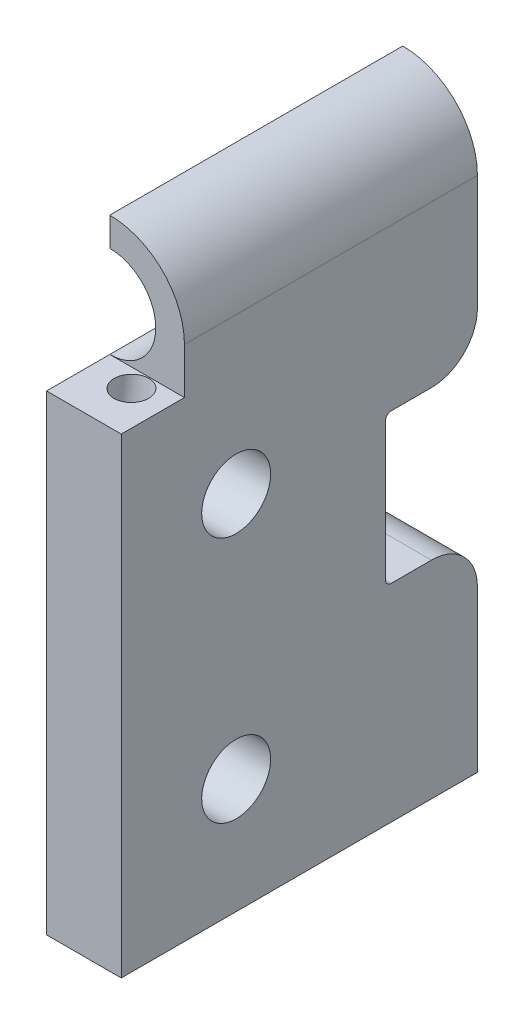
ISO-10303-21;
HEADER;
FILE_DESCRIPTION(('STEP AP214'),'2;1');
FILE_NAME('part.step','',(''),(''),'','','');
FILE_SCHEMA(('AUTOMOTIVE_DESIGN { 1 0 10303 214 1 1 1 1 }'));
ENDSEC;
DATA;
#1=APPLICATION_CONTEXT('core data for automotive mechanical design processes');
#2=APPLICATION_PROTOCOL_DEFINITION('international standard','automotive_design',2000,#1);
#3=PRODUCT_CONTEXT('',#1,'mechanical');
#4=PRODUCT('Part','Part','',(#3));
#5=PRODUCT_RELATED_PRODUCT_CATEGORY('part','',(#4));
#6=PRODUCT_DEFINITION_FORMATION('','',#4);
#7=PRODUCT_DEFINITION_CONTEXT('part definition',#1,'design');
#8=PRODUCT_DEFINITION('design','',#6,#7);
#9=PRODUCT_DEFINITION_SHAPE('','',#8);
#10=(LENGTH_UNIT() NAMED_UNIT(*) SI_UNIT(.MILLI.,.METRE.));
#11=(NAMED_UNIT(*) PLANE_ANGLE_UNIT() SI_UNIT($,.RADIAN.));
#12=(NAMED_UNIT(*) SI_UNIT($,.STERADIAN.) SOLID_ANGLE_UNIT());
#13=UNCERTAINTY_MEASURE_WITH_UNIT(LENGTH_MEASURE(1.E-05),#10,'distance_accuracy_value','');
#14=(GEOMETRIC_REPRESENTATION_CONTEXT(3) GLOBAL_UNCERTAINTY_ASSIGNED_CONTEXT((#13)) GLOBAL_UNIT_ASSIGNED_CONTEXT((#10,
#11,#12)) REPRESENTATION_CONTEXT('',''));
#15=CARTESIAN_POINT('',(0.,0.,0.));
#16=DIRECTION('',(0.,0.,1.));
#17=DIRECTION('',(1.,0.,0.));
#18=AXIS2_PLACEMENT_3D('',#15,#16,#17);
#19=CARTESIAN_POINT('',(-3.75,22.5,31.));
#20=DIRECTION('',(1.,0.,0.));
#21=DIRECTION('',(0.,1.,0.));
#22=AXIS2_PLACEMENT_3D('',#19,#20,#21);
#23=PLANE('',#22);
#24=DIRECTION('',(0.,-1.,0.));
#25=VECTOR('',#24,1.);
#26=CARTESIAN_POINT('',(-3.75,22.5,0.));
#27=LINE('',#26,#25);
#28=CARTESIAN_POINT('',(-3.75,29.,0.));
#29=VERTEX_POINT('',#28);
#30=CARTESIAN_POINT('',(-3.75,26.5,0.));
#31=VERTEX_POINT('',#30);
#32=EDGE_CURVE('E174',#29,#31,#27,.T.);
#33=ORIENTED_EDGE('',*,*,#32,.T.);
#34=DIRECTION('',(0.,0.,1.));
#35=VECTOR('',#34,1.);
#36=CARTESIAN_POINT('',(-3.75,26.5,-0.001000000000001));
#37=LINE('',#36,#35);
#38=CARTESIAN_POINT('',(-3.75,26.5,25.5));
#39=VERTEX_POINT('',#38);
#40=EDGE_CURVE('E155',#31,#39,#37,.T.);
#41=ORIENTED_EDGE('',*,*,#40,.T.);
#42=DIRECTION('',(0.,-1.,0.));
#43=VECTOR('',#42,1.);
#44=CARTESIAN_POINT('',(-3.75,29.,25.5));
#45=LINE('',#44,#43);
#46=CARTESIAN_POINT('',(-3.75,29.,25.5));
#47=VERTEX_POINT('',#46);
#48=EDGE_CURVE('E233',#47,#39,#45,.T.);
#49=ORIENTED_EDGE('',*,*,#48,.F.);
#50=DIRECTION('',(0.,0.,-1.));
#51=VECTOR('',#50,1.);
#52=CARTESIAN_POINT('',(-3.75,29.,31.));
#53=LINE('',#52,#51);
#54=EDGE_CURVE('E181',#47,#29,#53,.T.);
#55=ORIENTED_EDGE('',*,*,#54,.T.);
#56=EDGE_LOOP('',(#33,#41,#49,#55));
#57=FACE_BOUND('',#56,.T.);
#58=ADVANCED_FACE('F45',(#57),#23,.F.);
#59=CARTESIAN_POINT('',(-3.75,22.5,0.));
#60=DIRECTION('',(0.,0.,1.));
#61=DIRECTION('',(1.,0.,0.));
#62=AXIS2_PLACEMENT_3D('',#59,#60,#61);
#63=PLANE('',#62);
#64=CARTESIAN_POINT('',(-3.75,18.5,0.));
#65=VERTEX_POINT('',#64);
#66=CARTESIAN_POINT('',(-3.75,12.5,0.));
#67=VERTEX_POINT('',#66);
#68=EDGE_CURVE('E177',#65,#67,#27,.T.);
#69=ORIENTED_EDGE('',*,*,#68,.F.);
#70=CARTESIAN_POINT('',(-3.75,22.5,0.));
#71=DIRECTION('',(0.,0.,1.));
#72=DIRECTION('',(1.,0.,0.));
#73=AXIS2_PLACEMENT_3D('',#70,#71,#72);
#74=CIRCLE('',#73,4.);
#75=EDGE_CURVE('E158',#31,#65,#74,.F.);
#76=ORIENTED_EDGE('',*,*,#75,.F.);
#77=ORIENTED_EDGE('',*,*,#32,.F.);
#78=CARTESIAN_POINT('',(-3.75,22.5,0.));
#79=DIRECTION('',(0.,0.,1.));
#80=DIRECTION('',(1.,0.,0.));
#81=AXIS2_PLACEMENT_3D('',#78,#79,#80);
#82=CIRCLE('',#81,6.5);
#83=CARTESIAN_POINT('',(2.75,22.5,0.));
#84=VERTEX_POINT('',#83);
#85=EDGE_CURVE('E192',#84,#29,#82,.T.);
#86=ORIENTED_EDGE('',*,*,#85,.F.);
#87=DIRECTION('',(0.,1.,0.));
#88=VECTOR('',#87,1.);
#89=CARTESIAN_POINT('',(2.75,22.5,0.));
#90=LINE('',#89,#88);
#91=CARTESIAN_POINT('',(2.75,12.5,0.));
#92=VERTEX_POINT('',#91);
#93=EDGE_CURVE('E203',#92,#84,#90,.T.);
#94=ORIENTED_EDGE('',*,*,#93,.F.);
#95=DIRECTION('',(-1.,0.,0.));
#96=VECTOR('',#95,1.);
#97=CARTESIAN_POINT('',(-3.75,12.5,0.));
#98=LINE('',#97,#96);
#99=EDGE_CURVE('E55',#92,#67,#98,.T.);
#100=ORIENTED_EDGE('',*,*,#99,.T.);
#101=EDGE_LOOP('',(#69,#76,#77,#86,#94,#100));
#102=FACE_BOUND('',#101,.T.);
#103=ADVANCED_FACE('F172',(#102),#63,.F.);
#104=CARTESIAN_POINT('',(2.75,22.5,31.));
#105=DIRECTION('',(-1.,0.,0.));
#106=DIRECTION('',(0.,-1.,0.));
#107=AXIS2_PLACEMENT_3D('',#104,#105,#106);
#108=PLANE('',#107);
#109=CARTESIAN_POINT('',(2.75,9.,21.));
#110=DIRECTION('',(-1.,0.,0.));
#111=DIRECTION('',(0.,-1.,0.));
#112=AXIS2_PLACEMENT_3D('',#109,#110,#111);
#113=CIRCLE('',#112,3.);
#114=CARTESIAN_POINT('',(2.75,6.,21.));
#115=VERTEX_POINT('',#114);
#116=EDGE_CURVE('E236',#115,#115,#113,.T.);
#117=ORIENTED_EDGE('',*,*,#116,.T.);
#118=EDGE_LOOP('',(#117));
#119=FACE_BOUND('',#118,.T.);
#120=CARTESIAN_POINT('',(2.75000000000001,-12.5,21.));
#121=DIRECTION('',(-1.,0.,0.));
#122=DIRECTION('',(0.,-1.,0.));
#123=AXIS2_PLACEMENT_3D('',#120,#121,#122);
#124=CIRCLE('',#123,3.);
#125=CARTESIAN_POINT('',(2.75000000000001,-15.5,21.));
#126=VERTEX_POINT('',#125);
#127=EDGE_CURVE('E243',#126,#126,#124,.T.);
#128=ORIENTED_EDGE('',*,*,#127,.T.);
#129=EDGE_LOOP('',(#128));
#130=FACE_BOUND('',#129,.T.);
#131=CARTESIAN_POINT('',(2.75,-22.5,0.));
#132=VERTEX_POINT('',#131);
#133=CARTESIAN_POINT('',(2.75,-8.49999999999999,0.));
#134=VERTEX_POINT('',#133);
#135=EDGE_CURVE('E198',#132,#134,#90,.T.);
#136=ORIENTED_EDGE('',*,*,#135,.T.);
#137=CARTESIAN_POINT('',(2.75,-8.5,4.));
#138=DIRECTION('',(-1.,0.,0.));
#139=DIRECTION('',(0.,-1.,0.));
#140=AXIS2_PLACEMENT_3D('',#137,#138,#139);
#141=CIRCLE('',#140,4.);
#142=CARTESIAN_POINT('',(2.75,-4.5,4.));
#143=VERTEX_POINT('',#142);
#144=EDGE_CURVE('E398',#134,#143,#141,.F.);
#145=ORIENTED_EDGE('',*,*,#144,.T.);
#146=DIRECTION('',(0.,0.,-1.));
#147=VECTOR('',#146,1.);
#148=CARTESIAN_POINT('',(2.75,-4.5,0.));
#149=LINE('',#148,#147);
#150=CARTESIAN_POINT('',(2.75,-4.5,7.5));
#151=VERTEX_POINT('',#150);
#152=EDGE_CURVE('E248',#151,#143,#149,.T.);
#153=ORIENTED_EDGE('',*,*,#152,.F.);
#154=CARTESIAN_POINT('',(2.75,-4.,7.5));
#155=DIRECTION('',(-1.,0.,0.));
#156=DIRECTION('',(0.,-1.,0.));
#157=AXIS2_PLACEMENT_3D('',#154,#155,#156);
#158=CIRCLE('',#157,0.5);
#159=CARTESIAN_POINT('',(2.75,-4.,8.));
#160=VERTEX_POINT('',#159);
#161=EDGE_CURVE('E373',#151,#160,#158,.T.);
#162=ORIENTED_EDGE('',*,*,#161,.T.);
#163=DIRECTION('',(0.,-1.,0.));
#164=VECTOR('',#163,1.);
#165=CARTESIAN_POINT('',(2.75,8.5,8.));
#166=LINE('',#165,#164);
#167=CARTESIAN_POINT('',(2.75,8.,8.));
#168=VERTEX_POINT('',#167);
#169=EDGE_CURVE('E275',#168,#160,#166,.T.);
#170=ORIENTED_EDGE('',*,*,#169,.F.);
#171=CARTESIAN_POINT('',(2.75,8.,7.5));
#172=DIRECTION('',(-1.,0.,0.));
#173=DIRECTION('',(0.,-1.,0.));
#174=AXIS2_PLACEMENT_3D('',#171,#172,#173);
#175=CIRCLE('',#174,0.5);
#176=CARTESIAN_POINT('',(2.75,8.5,7.5));
#177=VERTEX_POINT('',#176);
#178=EDGE_CURVE('E379',#168,#177,#175,.T.);
#179=ORIENTED_EDGE('',*,*,#178,.T.);
#180=DIRECTION('',(0.,0.,1.));
#181=VECTOR('',#180,1.);
#182=CARTESIAN_POINT('',(2.75,8.5,0.));
#183=LINE('',#182,#181);
#184=CARTESIAN_POINT('',(2.75,8.5,4.));
#185=VERTEX_POINT('',#184);
#186=EDGE_CURVE('E272',#185,#177,#183,.T.);
#187=ORIENTED_EDGE('',*,*,#186,.F.);
#188=CARTESIAN_POINT('',(2.75,12.5,4.));
#189=DIRECTION('',(-1.,0.,0.));
#190=DIRECTION('',(0.,-1.,0.));
#191=AXIS2_PLACEMENT_3D('',#188,#189,#190);
#192=CIRCLE('',#191,4.);
#193=EDGE_CURVE('E62',#185,#92,#192,.F.);
#194=ORIENTED_EDGE('',*,*,#193,.T.);
#195=ORIENTED_EDGE('',*,*,#93,.T.);
#196=DIRECTION('',(0.,0.,-1.));
#197=VECTOR('',#196,1.);
#198=CARTESIAN_POINT('',(2.75,22.5,31.));
#199=LINE('',#198,#197);
#200=CARTESIAN_POINT('',(2.75,22.5,25.5));
#201=VERTEX_POINT('',#200);
#202=EDGE_CURVE('E343',#201,#84,#199,.T.);
#203=ORIENTED_EDGE('',*,*,#202,.F.);
#204=DIRECTION('',(0.,-1.,0.));
#205=VECTOR('',#204,1.);
#206=CARTESIAN_POINT('',(2.75,29.,25.5));
#207=LINE('',#206,#205);
#208=CARTESIAN_POINT('',(2.75,18.5,25.5));
#209=VERTEX_POINT('',#208);
#210=EDGE_CURVE('E232',#201,#209,#207,.T.);
#211=ORIENTED_EDGE('',*,*,#210,.T.);
#212=DIRECTION('',(0.,0.,1.));
#213=VECTOR('',#212,1.);
#214=CARTESIAN_POINT('',(2.75,18.5,31.));
#215=LINE('',#214,#213);
#216=CARTESIAN_POINT('',(2.75,18.5,31.));
#217=VERTEX_POINT('',#216);
#218=EDGE_CURVE('E225',#209,#217,#215,.T.);
#219=ORIENTED_EDGE('',*,*,#218,.T.);
#220=DIRECTION('',(0.,1.,0.));
#221=VECTOR('',#220,1.);
#222=CARTESIAN_POINT('',(2.75,22.5,31.));
#223=LINE('',#222,#221);
#224=CARTESIAN_POINT('',(2.75,-22.5,31.));
#225=VERTEX_POINT('',#224);
#226=EDGE_CURVE('E188',#225,#217,#223,.T.);
#227=ORIENTED_EDGE('',*,*,#226,.F.);
#228=DIRECTION('',(0.,0.,-1.));
#229=VECTOR('',#228,1.);
#230=CARTESIAN_POINT('',(2.75,-22.5,31.));
#231=LINE('',#230,#229);
#232=EDGE_CURVE('E209',#225,#132,#231,.T.);
#233=ORIENTED_EDGE('',*,*,#232,.T.);
#234=EDGE_LOOP('',(#136,#145,#153,#162,#170,#179,#187,#194,#195,#203,#211,#219,#227,#233));
#235=FACE_BOUND('',#234,.T.);
#236=ADVANCED_FACE('F314',(#119,#130,#235),#108,.F.);
#237=CARTESIAN_POINT('',(-3.75,22.5,31.));
#238=DIRECTION('',(0.,0.,-1.));
#239=DIRECTION('',(-1.,0.,0.));
#240=AXIS2_PLACEMENT_3D('',#237,#238,#239);
#241=CYLINDRICAL_SURFACE('',#240,6.5);
#242=ORIENTED_EDGE('',*,*,#54,.F.);
#243=CARTESIAN_POINT('',(-3.75,22.5,25.5));
#244=DIRECTION('',(0.,0.,-1.));
#245=DIRECTION('',(-1.,0.,0.));
#246=AXIS2_PLACEMENT_3D('',#243,#244,#245);
#247=CIRCLE('',#246,6.5);
#248=EDGE_CURVE('E216',#47,#201,#247,.T.);
#249=ORIENTED_EDGE('',*,*,#248,.T.);
#250=ORIENTED_EDGE('',*,*,#202,.T.);
#251=ORIENTED_EDGE('',*,*,#85,.T.);
#252=EDGE_LOOP('',(#242,#249,#250,#251));
#253=FACE_BOUND('',#252,.T.);
#254=ADVANCED_FACE('F321',(#253),#241,.T.);
#255=CARTESIAN_POINT('',(-3.75,9.,21.));
#256=DIRECTION('',(-1.,0.,0.));
#257=DIRECTION('',(0.,-1.,0.));
#258=AXIS2_PLACEMENT_3D('',#255,#256,#257);
#259=CIRCLE('',#258,3.);
#260=CARTESIAN_POINT('',(-3.75,6.,21.));
#261=VERTEX_POINT('',#260);
#262=EDGE_CURVE('E252',#261,#261,#259,.T.);
#263=ORIENTED_EDGE('',*,*,#262,.F.);
#264=EDGE_LOOP('',(#263));
#265=FACE_BOUND('',#264,.T.);
#266=CARTESIAN_POINT('',(-3.75,-12.5,21.));
#267=DIRECTION('',(-1.,0.,0.));
#268=DIRECTION('',(0.,-1.,0.));
#269=AXIS2_PLACEMENT_3D('',#266,#267,#268);
#270=CIRCLE('',#269,3.);
#271=CARTESIAN_POINT('',(-3.75,-15.5,21.));
#272=VERTEX_POINT('',#271);
#273=EDGE_CURVE('E247',#272,#272,#270,.T.);
#274=ORIENTED_EDGE('',*,*,#273,.F.);
#275=EDGE_LOOP('',(#274));
#276=FACE_BOUND('',#275,.T.);
#277=DIRECTION('',(0.,0.,1.));
#278=VECTOR('',#277,1.);
#279=CARTESIAN_POINT('',(-3.75,18.5,31.));
#280=LINE('',#279,#278);
#281=CARTESIAN_POINT('',(-3.75,18.5,25.5));
#282=VERTEX_POINT('',#281);
#283=CARTESIAN_POINT('',(-3.75,18.5,31.));
#284=VERTEX_POINT('',#283);
#285=EDGE_CURVE('E229',#282,#284,#280,.T.);
#286=ORIENTED_EDGE('',*,*,#285,.F.);
#287=DIRECTION('',(0.,0.,1.));
#288=VECTOR('',#287,1.);
#289=CARTESIAN_POINT('',(-3.75,18.5,-0.001000000000001));
#290=LINE('',#289,#288);
#291=EDGE_CURVE('E167',#65,#282,#290,.T.);
#292=ORIENTED_EDGE('',*,*,#291,.F.);
#293=ORIENTED_EDGE('',*,*,#68,.T.);
#294=CARTESIAN_POINT('',(-3.75,12.5,4.));
#295=DIRECTION('',(1.,0.,0.));
#296=DIRECTION('',(0.,1.,0.));
#297=AXIS2_PLACEMENT_3D('',#294,#295,#296);
#298=CIRCLE('',#297,4.);
#299=CARTESIAN_POINT('',(-3.75,8.5,4.));
#300=VERTEX_POINT('',#299);
#301=EDGE_CURVE('E387',#67,#300,#298,.F.);
#302=ORIENTED_EDGE('',*,*,#301,.T.);
#303=DIRECTION('',(0.,0.,-1.));
#304=VECTOR('',#303,1.);
#305=CARTESIAN_POINT('',(-3.75,8.5,0.));
#306=LINE('',#305,#304);
#307=CARTESIAN_POINT('',(-3.75,8.5,7.5));
#308=VERTEX_POINT('',#307);
#309=EDGE_CURVE('E262',#308,#300,#306,.T.);
#310=ORIENTED_EDGE('',*,*,#309,.F.);
#311=CARTESIAN_POINT('',(-3.75,8.,7.5));
#312=DIRECTION('',(1.,0.,0.));
#313=DIRECTION('',(0.,1.,0.));
#314=AXIS2_PLACEMENT_3D('',#311,#312,#313);
#315=CIRCLE('',#314,0.5);
#316=CARTESIAN_POINT('',(-3.75,8.,8.));
#317=VERTEX_POINT('',#316);
#318=EDGE_CURVE('E376',#308,#317,#315,.T.);
#319=ORIENTED_EDGE('',*,*,#318,.T.);
#320=DIRECTION('',(0.,1.,0.));
#321=VECTOR('',#320,1.);
#322=CARTESIAN_POINT('',(-3.75,8.5,8.));
#323=LINE('',#322,#321);
#324=CARTESIAN_POINT('',(-3.75,-4.,8.));
#325=VERTEX_POINT('',#324);
#326=EDGE_CURVE('E265',#325,#317,#323,.T.);
#327=ORIENTED_EDGE('',*,*,#326,.F.);
#328=CARTESIAN_POINT('',(-3.75,-4.,7.5));
#329=DIRECTION('',(1.,0.,0.));
#330=DIRECTION('',(0.,1.,0.));
#331=AXIS2_PLACEMENT_3D('',#328,#329,#330);
#332=CIRCLE('',#331,0.5);
#333=CARTESIAN_POINT('',(-3.75,-4.5,7.5));
#334=VERTEX_POINT('',#333);
#335=EDGE_CURVE('E369',#325,#334,#332,.T.);
#336=ORIENTED_EDGE('',*,*,#335,.T.);
#337=DIRECTION('',(0.,0.,1.));
#338=VECTOR('',#337,1.);
#339=CARTESIAN_POINT('',(-3.75,-4.5,0.));
#340=LINE('',#339,#338);
#341=CARTESIAN_POINT('',(-3.75,-4.5,4.));
#342=VERTEX_POINT('',#341);
#343=EDGE_CURVE('E269',#342,#334,#340,.T.);
#344=ORIENTED_EDGE('',*,*,#343,.F.);
#345=CARTESIAN_POINT('',(-3.75,-8.5,4.));
#346=DIRECTION('',(1.,0.,0.));
#347=DIRECTION('',(0.,1.,0.));
#348=AXIS2_PLACEMENT_3D('',#345,#346,#347);
#349=CIRCLE('',#348,4.);
#350=CARTESIAN_POINT('',(-3.75,-8.49999999999999,0.));
#351=VERTEX_POINT('',#350);
#352=EDGE_CURVE('E390',#342,#351,#349,.F.);
#353=ORIENTED_EDGE('',*,*,#352,.T.);
#354=CARTESIAN_POINT('',(-3.75,-22.5,0.));
#355=VERTEX_POINT('',#354);
#356=EDGE_CURVE('E185',#351,#355,#27,.T.);
#357=ORIENTED_EDGE('',*,*,#356,.T.);
#358=DIRECTION('',(0.,0.,-1.));
#359=VECTOR('',#358,1.);
#360=CARTESIAN_POINT('',(-3.75,-22.5,31.));
#361=LINE('',#360,#359);
#362=CARTESIAN_POINT('',(-3.75,-22.5,31.));
#363=VERTEX_POINT('',#362);
#364=EDGE_CURVE('E347',#363,#355,#361,.T.);
#365=ORIENTED_EDGE('',*,*,#364,.F.);
#366=DIRECTION('',(0.,-1.,0.));
#367=VECTOR('',#366,1.);
#368=CARTESIAN_POINT('',(-3.75,29.,31.));
#369=LINE('',#368,#367);
#370=EDGE_CURVE('E210',#284,#363,#369,.T.);
#371=ORIENTED_EDGE('',*,*,#370,.F.);
#372=EDGE_LOOP('',(#286,#292,#293,#302,#310,#319,#327,#336,#344,#353,#357,#365,#371));
#373=FACE_BOUND('',#372,.T.);
#374=ADVANCED_FACE('F309',(#265,#276,#373),#23,.F.);
#375=CARTESIAN_POINT('',(-3.75,-22.5,31.));
#376=DIRECTION('',(0.,1.,0.));
#377=DIRECTION('',(0.,0.,1.));
#378=AXIS2_PLACEMENT_3D('',#375,#376,#377);
#379=PLANE('',#378);
#380=DIRECTION('',(1.,0.,0.));
#381=VECTOR('',#380,1.);
#382=CARTESIAN_POINT('',(-3.75,-22.5,0.));
#383=LINE('',#382,#381);
#384=EDGE_CURVE('E183',#355,#132,#383,.T.);
#385=ORIENTED_EDGE('',*,*,#384,.T.);
#386=ORIENTED_EDGE('',*,*,#232,.F.);
#387=DIRECTION('',(1.,0.,0.));
#388=VECTOR('',#387,1.);
#389=CARTESIAN_POINT('',(-3.75,-22.5,31.));
#390=LINE('',#389,#388);
#391=EDGE_CURVE('E206',#363,#225,#390,.T.);
#392=ORIENTED_EDGE('',*,*,#391,.F.);
#393=ORIENTED_EDGE('',*,*,#364,.T.);
#394=EDGE_LOOP('',(#385,#386,#392,#393));
#395=FACE_BOUND('',#394,.T.);
#396=ADVANCED_FACE('F320',(#395),#379,.F.);
#397=CARTESIAN_POINT('',(-3.75,22.5,31.));
#398=DIRECTION('',(0.,0.,1.));
#399=DIRECTION('',(1.,0.,0.));
#400=AXIS2_PLACEMENT_3D('',#397,#398,#399);
#401=PLANE('',#400);
#402=DIRECTION('',(-1.,0.,0.));
#403=VECTOR('',#402,1.);
#404=CARTESIAN_POINT('',(2.75,18.5,31.));
#405=LINE('',#404,#403);
#406=EDGE_CURVE('E220',#217,#284,#405,.T.);
#407=ORIENTED_EDGE('',*,*,#406,.T.);
#408=ORIENTED_EDGE('',*,*,#370,.T.);
#409=ORIENTED_EDGE('',*,*,#391,.T.);
#410=ORIENTED_EDGE('',*,*,#226,.T.);
#411=EDGE_LOOP('',(#407,#408,#409,#410));
#412=FACE_BOUND('',#411,.T.);
#413=ADVANCED_FACE('F327',(#412),#401,.T.);
#414=ORIENTED_EDGE('',*,*,#356,.F.);
#415=DIRECTION('',(-1.,0.,0.));
#416=VECTOR('',#415,1.);
#417=CARTESIAN_POINT('',(-3.75,-8.5,0.));
#418=LINE('',#417,#416);
#419=EDGE_CURVE('E393',#351,#134,#418,.F.);
#420=ORIENTED_EDGE('',*,*,#419,.T.);
#421=ORIENTED_EDGE('',*,*,#135,.F.);
#422=ORIENTED_EDGE('',*,*,#384,.F.);
#423=EDGE_LOOP('',(#414,#420,#421,#422));
#424=FACE_BOUND('',#423,.T.);
#425=ADVANCED_FACE('F316',(#424),#63,.F.);
#426=CARTESIAN_POINT('',(2.75,29.,25.5));
#427=DIRECTION('',(0.,0.,-1.));
#428=DIRECTION('',(-1.,0.,0.));
#429=AXIS2_PLACEMENT_3D('',#426,#427,#428);
#430=PLANE('',#429);
#431=ORIENTED_EDGE('',*,*,#48,.T.);
#432=CARTESIAN_POINT('',(-3.75,22.5,25.5));
#433=DIRECTION('',(0.,0.,1.));
#434=DIRECTION('',(1.,0.,0.));
#435=AXIS2_PLACEMENT_3D('',#432,#433,#434);
#436=CIRCLE('',#435,4.);
#437=EDGE_CURVE('E161',#282,#39,#436,.T.);
#438=ORIENTED_EDGE('',*,*,#437,.F.);
#439=DIRECTION('',(-1.,0.,0.));
#440=VECTOR('',#439,1.);
#441=CARTESIAN_POINT('',(2.75,18.5,25.5));
#442=LINE('',#441,#440);
#443=EDGE_CURVE('E221',#209,#282,#442,.T.);
#444=ORIENTED_EDGE('',*,*,#443,.F.);
#445=ORIENTED_EDGE('',*,*,#210,.F.);
#446=ORIENTED_EDGE('',*,*,#248,.F.);
#447=EDGE_LOOP('',(#431,#438,#444,#445,#446));
#448=FACE_BOUND('',#447,.T.);
#449=ADVANCED_FACE('F345',(#448),#430,.F.);
#450=CARTESIAN_POINT('',(2.75,18.5,31.));
#451=DIRECTION('',(0.,-1.,0.));
#452=DIRECTION('',(1.,0.,0.));
#453=AXIS2_PLACEMENT_3D('',#450,#451,#452);
#454=PLANE('',#453);
#455=CARTESIAN_POINT('',(-0.249999999999998,18.5,27.1157241160298));
#456=DIRECTION('',(0.,-1.,0.));
#457=DIRECTION('',(0.,0.,-1.));
#458=AXIS2_PLACEMENT_3D('',#455,#456,#457);
#459=ELLIPSE('',#458,1.51474135877793,1.5);
#460=CARTESIAN_POINT('',(-0.249999999999996,18.5,25.6009827572519));
#461=VERTEX_POINT('',#460);
#462=EDGE_CURVE('E49',#461,#461,#459,.T.);
#463=ORIENTED_EDGE('',*,*,#462,.T.);
#464=EDGE_LOOP('',(#463));
#465=FACE_BOUND('',#464,.T.);
#466=ORIENTED_EDGE('',*,*,#285,.T.);
#467=ORIENTED_EDGE('',*,*,#406,.F.);
#468=ORIENTED_EDGE('',*,*,#218,.F.);
#469=ORIENTED_EDGE('',*,*,#443,.T.);
#470=EDGE_LOOP('',(#466,#467,#468,#469));
#471=FACE_BOUND('',#470,.T.);
#472=ADVANCED_FACE('F292',(#465,#471),#454,.F.);
#473=CARTESIAN_POINT('',(2.75000000000001,-12.5,21.));
#474=DIRECTION('',(-1.,0.,0.));
#475=DIRECTION('',(0.,-1.,0.));
#476=AXIS2_PLACEMENT_3D('',#473,#474,#475);
#477=CYLINDRICAL_SURFACE('',#476,3.);
#478=ORIENTED_EDGE('',*,*,#127,.F.);
#479=EDGE_LOOP('',(#478));
#480=FACE_BOUND('',#479,.T.);
#481=ORIENTED_EDGE('',*,*,#273,.T.);
#482=EDGE_LOOP('',(#481));
#483=FACE_BOUND('',#482,.T.);
#484=ADVANCED_FACE('F443',(#480,#483),#477,.F.);
#485=CARTESIAN_POINT('',(2.75,9.,21.));
#486=DIRECTION('',(-1.,0.,0.));
#487=DIRECTION('',(0.,-1.,0.));
#488=AXIS2_PLACEMENT_3D('',#485,#486,#487);
#489=CYLINDRICAL_SURFACE('',#488,3.);
#490=ORIENTED_EDGE('',*,*,#116,.F.);
#491=EDGE_LOOP('',(#490));
#492=FACE_BOUND('',#491,.T.);
#493=ORIENTED_EDGE('',*,*,#262,.T.);
#494=EDGE_LOOP('',(#493));
#495=FACE_BOUND('',#494,.T.);
#496=ADVANCED_FACE('F446',(#492,#495),#489,.F.);
#497=CARTESIAN_POINT('',(2.75100000000001,8.5,0.));
#498=DIRECTION('',(0.,1.,0.));
#499=DIRECTION('',(-1.,0.,0.));
#500=AXIS2_PLACEMENT_3D('',#497,#498,#499);
#501=PLANE('',#500);
#502=ORIENTED_EDGE('',*,*,#309,.T.);
#503=DIRECTION('',(-1.,0.,0.));
#504=VECTOR('',#503,1.);
#505=CARTESIAN_POINT('',(2.75100000000001,8.5,4.));
#506=LINE('',#505,#504);
#507=EDGE_CURVE('E11',#300,#185,#506,.F.);
#508=ORIENTED_EDGE('',*,*,#507,.T.);
#509=ORIENTED_EDGE('',*,*,#186,.T.);
#510=DIRECTION('',(-1.,0.,0.));
#511=VECTOR('',#510,1.);
#512=CARTESIAN_POINT('',(-3.75,8.5,7.5));
#513=LINE('',#512,#511);
#514=EDGE_CURVE('E365',#177,#308,#513,.T.);
#515=ORIENTED_EDGE('',*,*,#514,.T.);
#516=EDGE_LOOP('',(#502,#508,#509,#515));
#517=FACE_BOUND('',#516,.T.);
#518=ADVANCED_FACE('F406',(#517),#501,.F.);
#519=CARTESIAN_POINT('',(2.75100000000001,8.5,8.));
#520=DIRECTION('',(0.,0.,1.));
#521=DIRECTION('',(0.,-1.,0.));
#522=AXIS2_PLACEMENT_3D('',#519,#520,#521);
#523=PLANE('',#522);
#524=ORIENTED_EDGE('',*,*,#169,.T.);
#525=DIRECTION('',(-1.,0.,0.));
#526=VECTOR('',#525,1.);
#527=CARTESIAN_POINT('',(-3.75,-4.,8.));
#528=LINE('',#527,#526);
#529=EDGE_CURVE('E358',#160,#325,#528,.T.);
#530=ORIENTED_EDGE('',*,*,#529,.T.);
#531=ORIENTED_EDGE('',*,*,#326,.T.);
#532=DIRECTION('',(-1.,0.,0.));
#533=VECTOR('',#532,1.);
#534=CARTESIAN_POINT('',(2.75,8.,8.));
#535=LINE('',#534,#533);
#536=EDGE_CURVE('E351',#317,#168,#535,.F.);
#537=ORIENTED_EDGE('',*,*,#536,.T.);
#538=EDGE_LOOP('',(#524,#530,#531,#537));
#539=FACE_BOUND('',#538,.T.);
#540=ADVANCED_FACE('F414',(#539),#523,.F.);
#541=CARTESIAN_POINT('',(2.75100000000001,-4.5,0.));
#542=DIRECTION('',(0.,-1.,0.));
#543=DIRECTION('',(1.,0.,0.));
#544=AXIS2_PLACEMENT_3D('',#541,#542,#543);
#545=PLANE('',#544);
#546=ORIENTED_EDGE('',*,*,#152,.T.);
#547=DIRECTION('',(-1.,0.,0.));
#548=VECTOR('',#547,1.);
#549=CARTESIAN_POINT('',(2.75100000000001,-4.5,4.));
#550=LINE('',#549,#548);
#551=EDGE_CURVE('E383',#143,#342,#550,.T.);
#552=ORIENTED_EDGE('',*,*,#551,.T.);
#553=ORIENTED_EDGE('',*,*,#343,.T.);
#554=DIRECTION('',(-1.,0.,0.));
#555=VECTOR('',#554,1.);
#556=CARTESIAN_POINT('',(2.75,-4.5,7.5));
#557=LINE('',#556,#555);
#558=EDGE_CURVE('E362',#334,#151,#557,.F.);
#559=ORIENTED_EDGE('',*,*,#558,.T.);
#560=EDGE_LOOP('',(#546,#552,#553,#559));
#561=FACE_BOUND('',#560,.T.);
#562=ADVANCED_FACE('F423',(#561),#545,.F.);
#563=CARTESIAN_POINT('',(2.75100000000001,-4.,7.5));
#564=DIRECTION('',(1.,0.,0.));
#565=DIRECTION('',(0.,1.,0.));
#566=AXIS2_PLACEMENT_3D('',#563,#564,#565);
#567=CYLINDRICAL_SURFACE('',#566,0.5);
#568=ORIENTED_EDGE('',*,*,#161,.F.);
#569=ORIENTED_EDGE('',*,*,#558,.F.);
#570=ORIENTED_EDGE('',*,*,#335,.F.);
#571=ORIENTED_EDGE('',*,*,#529,.F.);
#572=EDGE_LOOP('',(#568,#569,#570,#571));
#573=FACE_BOUND('',#572,.T.);
#574=ADVANCED_FACE('F419',(#573),#567,.F.);
#575=CARTESIAN_POINT('',(2.75100000000001,8.,7.5));
#576=DIRECTION('',(1.,0.,0.));
#577=DIRECTION('',(0.,1.,0.));
#578=AXIS2_PLACEMENT_3D('',#575,#576,#577);
#579=CYLINDRICAL_SURFACE('',#578,0.5);
#580=ORIENTED_EDGE('',*,*,#178,.F.);
#581=ORIENTED_EDGE('',*,*,#536,.F.);
#582=ORIENTED_EDGE('',*,*,#318,.F.);
#583=ORIENTED_EDGE('',*,*,#514,.F.);
#584=EDGE_LOOP('',(#580,#581,#582,#583));
#585=FACE_BOUND('',#584,.T.);
#586=ADVANCED_FACE('F410',(#585),#579,.F.);
#587=CARTESIAN_POINT('',(2.75100000000001,-8.5,4.));
#588=DIRECTION('',(-1.,0.,0.));
#589=DIRECTION('',(0.,-1.,0.));
#590=AXIS2_PLACEMENT_3D('',#587,#588,#589);
#591=CYLINDRICAL_SURFACE('',#590,4.);
#592=ORIENTED_EDGE('',*,*,#144,.F.);
#593=ORIENTED_EDGE('',*,*,#419,.F.);
#594=ORIENTED_EDGE('',*,*,#352,.F.);
#595=ORIENTED_EDGE('',*,*,#551,.F.);
#596=EDGE_LOOP('',(#592,#593,#594,#595));
#597=FACE_BOUND('',#596,.T.);
#598=ADVANCED_FACE('F428',(#597),#591,.T.);
#599=CARTESIAN_POINT('',(-3.75,12.5,4.));
#600=DIRECTION('',(-1.,0.,0.));
#601=DIRECTION('',(0.,-1.,0.));
#602=AXIS2_PLACEMENT_3D('',#599,#600,#601);
#603=CYLINDRICAL_SURFACE('',#602,4.);
#604=ORIENTED_EDGE('',*,*,#193,.F.);
#605=ORIENTED_EDGE('',*,*,#507,.F.);
#606=ORIENTED_EDGE('',*,*,#301,.F.);
#607=ORIENTED_EDGE('',*,*,#99,.F.);
#608=EDGE_LOOP('',(#604,#605,#606,#607));
#609=FACE_BOUND('',#608,.T.);
#610=ADVANCED_FACE('F47',(#609),#603,.T.);
#611=CARTESIAN_POINT('',(-3.75,22.5,-0.001000000000001));
#612=DIRECTION('',(0.,0.,1.));
#613=DIRECTION('',(1.,0.,0.));
#614=AXIS2_PLACEMENT_3D('',#611,#612,#613);
#615=CYLINDRICAL_SURFACE('',#614,4.);
#616=ORIENTED_EDGE('',*,*,#75,.T.);
#617=ORIENTED_EDGE('',*,*,#291,.T.);
#618=ORIENTED_EDGE('',*,*,#437,.T.);
#619=ORIENTED_EDGE('',*,*,#40,.F.);
#620=EDGE_LOOP('',(#616,#617,#618,#619));
#621=FACE_BOUND('',#620,.T.);
#622=ADVANCED_FACE('F157',(#621),#615,.F.);
#623=CARTESIAN_POINT('',(-0.249999999999998,1.88811979292941,29.4503716263076));
#624=DIRECTION('',(0.,0.99026806874157,-0.139173100960066));
#625=DIRECTION('',(0.,0.139173100960066,0.99026806874157));
#626=AXIS2_PLACEMENT_3D('',#623,#624,#625);
#627=CYLINDRICAL_SURFACE('',#626,1.5);
#628=CARTESIAN_POINT('',(-0.249999999999998,1.88811979292941,29.4503716263076));
#629=DIRECTION('',(0.,0.99026806874157,-0.139173100960066));
#630=DIRECTION('',(0.,0.139173100960066,0.99026806874157));
#631=AXIS2_PLACEMENT_3D('',#628,#629,#630);
#632=CIRCLE('',#631,1.5);
#633=CARTESIAN_POINT('',(-0.249999999999998,2.09687944436951,30.93577372942));
#634=VERTEX_POINT('',#633);
#635=EDGE_CURVE('E283',#634,#634,#632,.T.);
#636=ORIENTED_EDGE('',*,*,#635,.F.);
#637=EDGE_LOOP('',(#636));
#638=FACE_BOUND('',#637,.T.);
#639=ORIENTED_EDGE('',*,*,#462,.F.);
#640=EDGE_LOOP('',(#639));
#641=FACE_BOUND('',#640,.T.);
#642=ADVANCED_FACE('F295',(#638,#641),#627,.F.);
#643=CARTESIAN_POINT('',(-0.249999999999998,1.88811979292941,29.4503716263076));
#644=DIRECTION('',(0.,0.99026806874157,-0.139173100960066));
#645=DIRECTION('',(0.,0.139173100960066,0.99026806874157));
#646=AXIS2_PLACEMENT_3D('',#643,#644,#645);
#647=PLANE('',#646);
#648=ORIENTED_EDGE('',*,*,#635,.T.);
#649=EDGE_LOOP('',(#648));
#650=FACE_BOUND('',#649,.T.);
#651=ADVANCED_FACE('F297',(#650),#647,.T.);
#652=CLOSED_SHELL('',(#58,#103,#236,#254,#374,#396,#413,#425,#449,#472,#484,#496,#518,#540,#562,
#574,#586,#598,#610,#622,#642,#651));
#653=MANIFOLD_SOLID_BREP('B2',#652);
#654=ADVANCED_BREP_SHAPE_REPRESENTATION('',(#18,#653),#14);
#655=SHAPE_DEFINITION_REPRESENTATION(#9,#654);
ENDSEC;
END-ISO-10303-21;
